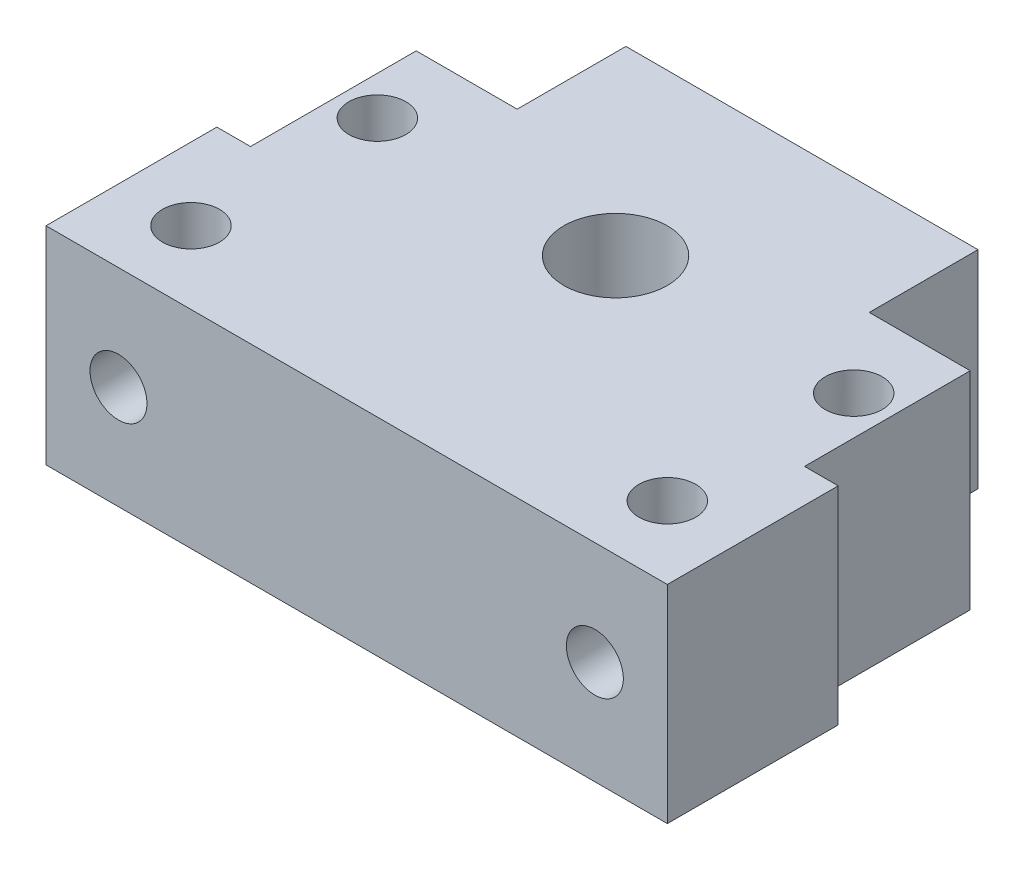
ISO-10303-21;
HEADER;
FILE_DESCRIPTION(('STEP AP214'),'2;1');
FILE_NAME('part.step','',(''),(''),'','','');
FILE_SCHEMA(('AUTOMOTIVE_DESIGN { 1 0 10303 214 1 1 1 1 }'));
ENDSEC;
DATA;
#1=APPLICATION_CONTEXT('core data for automotive mechanical design processes');
#2=APPLICATION_PROTOCOL_DEFINITION('international standard','automotive_design',2000,#1);
#3=PRODUCT_CONTEXT('',#1,'mechanical');
#4=PRODUCT('Part','Part','',(#3));
#5=PRODUCT_RELATED_PRODUCT_CATEGORY('part','',(#4));
#6=PRODUCT_DEFINITION_FORMATION('','',#4);
#7=PRODUCT_DEFINITION_CONTEXT('part definition',#1,'design');
#8=PRODUCT_DEFINITION('design','',#6,#7);
#9=PRODUCT_DEFINITION_SHAPE('','',#8);
#10=(LENGTH_UNIT() NAMED_UNIT(*) SI_UNIT(.MILLI.,.METRE.));
#11=(NAMED_UNIT(*) PLANE_ANGLE_UNIT() SI_UNIT($,.RADIAN.));
#12=(NAMED_UNIT(*) SI_UNIT($,.STERADIAN.) SOLID_ANGLE_UNIT());
#13=UNCERTAINTY_MEASURE_WITH_UNIT(LENGTH_MEASURE(1.E-05),#10,'distance_accuracy_value','');
#14=(GEOMETRIC_REPRESENTATION_CONTEXT(3) GLOBAL_UNCERTAINTY_ASSIGNED_CONTEXT((#13)) GLOBAL_UNIT_ASSIGNED_CONTEXT((#10,
#11,#12)) REPRESENTATION_CONTEXT('',''));
#15=CARTESIAN_POINT('',(0.,0.,0.));
#16=DIRECTION('',(0.,0.,1.));
#17=DIRECTION('',(1.,0.,0.));
#18=AXIS2_PLACEMENT_3D('',#15,#16,#17);
#19=CARTESIAN_POINT('',(-23.,20.,-3.49999999999999));
#20=DIRECTION('',(0.,-1.,0.));
#21=DIRECTION('',(0.,0.,-1.));
#22=AXIS2_PLACEMENT_3D('',#19,#20,#21);
#23=CYLINDRICAL_SURFACE('',#22,2.75);
#24=CARTESIAN_POINT('',(-23.,10.,-3.49999999999999));
#25=DIRECTION('',(0.,-0.707106781186547,-0.707106781186547));
#26=DIRECTION('',(0.,-0.707106781186547,0.707106781186547));
#27=AXIS2_PLACEMENT_3D('',#24,#25,#26);
#28=ELLIPSE('',#27,3.88908729652601,2.75);
#29=CARTESIAN_POINT('',(-20.25,10.,-3.49999999999999));
#30=VERTEX_POINT('',#29);
#31=CARTESIAN_POINT('',(-25.75,10.,-3.49999999999999));
#32=VERTEX_POINT('',#31);
#33=EDGE_CURVE('E196',#30,#32,#28,.F.);
#34=ORIENTED_EDGE('',*,*,#33,.F.);
#35=CARTESIAN_POINT('',(-23.,10.,-3.49999999999999));
#36=DIRECTION('',(0.,-0.707106781186547,0.707106781186547));
#37=DIRECTION('',(0.,-0.707106781186547,-0.707106781186547));
#38=AXIS2_PLACEMENT_3D('',#35,#36,#37);
#39=ELLIPSE('',#38,3.88908729652601,2.75);
#40=EDGE_CURVE('E186',#32,#30,#39,.F.);
#41=ORIENTED_EDGE('',*,*,#40,.F.);
#42=EDGE_LOOP('',(#34,#41));
#43=FACE_BOUND('',#42,.T.);
#44=CARTESIAN_POINT('',(-23.,20.,-3.49999999999999));
#45=DIRECTION('',(0.,1.,0.));
#46=DIRECTION('',(0.,0.,1.));
#47=AXIS2_PLACEMENT_3D('',#44,#45,#46);
#48=CIRCLE('',#47,2.75);
#49=CARTESIAN_POINT('',(-23.,20.,-0.749999999999995));
#50=VERTEX_POINT('',#49);
#51=EDGE_CURVE('E235',#50,#50,#48,.T.);
#52=ORIENTED_EDGE('',*,*,#51,.T.);
#53=EDGE_LOOP('',(#52));
#54=FACE_BOUND('',#53,.T.);
#55=ADVANCED_FACE('F35',(#43,#54),#23,.F.);
#56=CARTESIAN_POINT('',(-23.,20.,14.5));
#57=DIRECTION('',(0.,-1.,0.));
#58=DIRECTION('',(0.,0.,-1.));
#59=AXIS2_PLACEMENT_3D('',#56,#57,#58);
#60=CYLINDRICAL_SURFACE('',#59,2.75);
#61=CARTESIAN_POINT('',(-23.,10.,14.5));
#62=DIRECTION('',(0.,-0.707106781186547,-0.707106781186547));
#63=DIRECTION('',(0.,-0.707106781186547,0.707106781186547));
#64=AXIS2_PLACEMENT_3D('',#61,#62,#63);
#65=ELLIPSE('',#64,3.88908729652601,2.75);
#66=CARTESIAN_POINT('',(-20.25,10.,14.5));
#67=VERTEX_POINT('',#66);
#68=CARTESIAN_POINT('',(-25.75,10.,14.5));
#69=VERTEX_POINT('',#68);
#70=EDGE_CURVE('E319',#67,#69,#65,.F.);
#71=ORIENTED_EDGE('',*,*,#70,.F.);
#72=CARTESIAN_POINT('',(-23.,10.,14.5));
#73=DIRECTION('',(0.,-0.707106781186547,0.707106781186547));
#74=DIRECTION('',(0.,-0.707106781186547,-0.707106781186547));
#75=AXIS2_PLACEMENT_3D('',#72,#73,#74);
#76=ELLIPSE('',#75,3.88908729652601,2.75);
#77=EDGE_CURVE('E311',#69,#67,#76,.F.);
#78=ORIENTED_EDGE('',*,*,#77,.F.);
#79=EDGE_LOOP('',(#71,#78));
#80=FACE_BOUND('',#79,.T.);
#81=CARTESIAN_POINT('',(-23.,20.,14.5));
#82=DIRECTION('',(0.,1.,0.));
#83=DIRECTION('',(0.,0.,1.));
#84=AXIS2_PLACEMENT_3D('',#81,#82,#83);
#85=CIRCLE('',#84,2.75);
#86=CARTESIAN_POINT('',(-23.,20.,17.25));
#87=VERTEX_POINT('',#86);
#88=EDGE_CURVE('E229',#87,#87,#85,.T.);
#89=ORIENTED_EDGE('',*,*,#88,.T.);
#90=EDGE_LOOP('',(#89));
#91=FACE_BOUND('',#90,.T.);
#92=ADVANCED_FACE('F379',(#80,#91),#60,.F.);
#93=CARTESIAN_POINT('',(23.,20.,-3.5));
#94=DIRECTION('',(0.,-1.,0.));
#95=DIRECTION('',(0.,0.,-1.));
#96=AXIS2_PLACEMENT_3D('',#93,#94,#95);
#97=CYLINDRICAL_SURFACE('',#96,2.75);
#98=CARTESIAN_POINT('',(23.,10.,-3.5));
#99=DIRECTION('',(0.,-0.707106781186547,-0.707106781186547));
#100=DIRECTION('',(0.,-0.707106781186547,0.707106781186547));
#101=AXIS2_PLACEMENT_3D('',#98,#99,#100);
#102=ELLIPSE('',#101,3.88908729652601,2.75);
#103=CARTESIAN_POINT('',(25.75,10.,-3.5));
#104=VERTEX_POINT('',#103);
#105=CARTESIAN_POINT('',(20.25,10.,-3.5));
#106=VERTEX_POINT('',#105);
#107=EDGE_CURVE('E213',#104,#106,#102,.F.);
#108=ORIENTED_EDGE('',*,*,#107,.F.);
#109=CARTESIAN_POINT('',(23.,10.,-3.5));
#110=DIRECTION('',(0.,-0.707106781186547,0.707106781186547));
#111=DIRECTION('',(0.,-0.707106781186547,-0.707106781186547));
#112=AXIS2_PLACEMENT_3D('',#109,#110,#111);
#113=ELLIPSE('',#112,3.88908729652601,2.75);
#114=EDGE_CURVE('E203',#106,#104,#113,.F.);
#115=ORIENTED_EDGE('',*,*,#114,.F.);
#116=EDGE_LOOP('',(#108,#115));
#117=FACE_BOUND('',#116,.T.);
#118=CARTESIAN_POINT('',(23.,20.,-3.5));
#119=DIRECTION('',(0.,1.,0.));
#120=DIRECTION('',(0.,0.,1.));
#121=AXIS2_PLACEMENT_3D('',#118,#119,#120);
#122=CIRCLE('',#121,2.75);
#123=CARTESIAN_POINT('',(23.,20.,-0.750000000000002));
#124=VERTEX_POINT('',#123);
#125=EDGE_CURVE('E223',#124,#124,#122,.T.);
#126=ORIENTED_EDGE('',*,*,#125,.T.);
#127=EDGE_LOOP('',(#126));
#128=FACE_BOUND('',#127,.T.);
#129=ADVANCED_FACE('F386',(#117,#128),#97,.F.);
#130=CARTESIAN_POINT('',(23.,20.,14.5));
#131=DIRECTION('',(0.,-1.,0.));
#132=DIRECTION('',(0.,0.,-1.));
#133=AXIS2_PLACEMENT_3D('',#130,#131,#132);
#134=CYLINDRICAL_SURFACE('',#133,2.75);
#135=CARTESIAN_POINT('',(23.,10.,14.5));
#136=DIRECTION('',(0.,-0.707106781186547,-0.707106781186547));
#137=DIRECTION('',(0.,-0.707106781186547,0.707106781186547));
#138=AXIS2_PLACEMENT_3D('',#135,#136,#137);
#139=ELLIPSE('',#138,3.88908729652601,2.75);
#140=CARTESIAN_POINT('',(25.75,10.,14.5));
#141=VERTEX_POINT('',#140);
#142=CARTESIAN_POINT('',(20.25,10.,14.5));
#143=VERTEX_POINT('',#142);
#144=EDGE_CURVE('E308',#141,#143,#139,.F.);
#145=ORIENTED_EDGE('',*,*,#144,.F.);
#146=CARTESIAN_POINT('',(23.,10.,14.5));
#147=DIRECTION('',(0.,-0.707106781186547,0.707106781186547));
#148=DIRECTION('',(0.,-0.707106781186547,-0.707106781186547));
#149=AXIS2_PLACEMENT_3D('',#146,#147,#148);
#150=ELLIPSE('',#149,3.88908729652601,2.75);
#151=EDGE_CURVE('E300',#143,#141,#150,.F.);
#152=ORIENTED_EDGE('',*,*,#151,.F.);
#153=EDGE_LOOP('',(#145,#152));
#154=FACE_BOUND('',#153,.T.);
#155=CARTESIAN_POINT('',(23.,20.,14.5));
#156=DIRECTION('',(0.,1.,0.));
#157=DIRECTION('',(0.,0.,1.));
#158=AXIS2_PLACEMENT_3D('',#155,#156,#157);
#159=CIRCLE('',#158,2.75);
#160=CARTESIAN_POINT('',(23.,20.,17.25));
#161=VERTEX_POINT('',#160);
#162=EDGE_CURVE('E217',#161,#161,#159,.T.);
#163=ORIENTED_EDGE('',*,*,#162,.T.);
#164=EDGE_LOOP('',(#163));
#165=FACE_BOUND('',#164,.T.);
#166=ADVANCED_FACE('F421',(#154,#165),#134,.F.);
#167=CARTESIAN_POINT('',(0.,20.,0.));
#168=DIRECTION('',(0.,-1.,0.));
#169=DIRECTION('',(0.,0.,-1.));
#170=AXIS2_PLACEMENT_3D('',#167,#168,#169);
#171=PLANE('',#170);
#172=ORIENTED_EDGE('',*,*,#125,.F.);
#173=EDGE_LOOP('',(#172));
#174=FACE_BOUND('',#173,.T.);
#175=ORIENTED_EDGE('',*,*,#51,.F.);
#176=EDGE_LOOP('',(#175));
#177=FACE_BOUND('',#176,.T.);
#178=DIRECTION('',(0.,0.,1.));
#179=VECTOR('',#178,1.);
#180=CARTESIAN_POINT('',(-26.75,20.,-27.));
#181=LINE('',#180,#179);
#182=CARTESIAN_POINT('',(-26.75,20.,-11.));
#183=VERTEX_POINT('',#182);
#184=CARTESIAN_POINT('',(-26.75,20.,4.99999999999999));
#185=VERTEX_POINT('',#184);
#186=EDGE_CURVE('E152',#183,#185,#181,.T.);
#187=ORIENTED_EDGE('',*,*,#186,.T.);
#188=DIRECTION('',(-1.,0.,0.));
#189=VECTOR('',#188,1.);
#190=CARTESIAN_POINT('',(-33.25,20.,4.99999999999999));
#191=LINE('',#190,#189);
#192=CARTESIAN_POINT('',(-30.,20.,4.99999999999999));
#193=VERTEX_POINT('',#192);
#194=EDGE_CURVE('E155',#185,#193,#191,.T.);
#195=ORIENTED_EDGE('',*,*,#194,.T.);
#196=DIRECTION('',(0.,0.,1.));
#197=VECTOR('',#196,1.);
#198=CARTESIAN_POINT('',(-30.,20.,21.5));
#199=LINE('',#198,#197);
#200=CARTESIAN_POINT('',(-30.,20.,21.5));
#201=VERTEX_POINT('',#200);
#202=EDGE_CURVE('E256',#193,#201,#199,.T.);
#203=ORIENTED_EDGE('',*,*,#202,.T.);
#204=DIRECTION('',(1.,0.,0.));
#205=VECTOR('',#204,1.);
#206=CARTESIAN_POINT('',(30.,20.,21.5));
#207=LINE('',#206,#205);
#208=CARTESIAN_POINT('',(30.,20.,21.5));
#209=VERTEX_POINT('',#208);
#210=EDGE_CURVE('E258',#201,#209,#207,.T.);
#211=ORIENTED_EDGE('',*,*,#210,.T.);
#212=DIRECTION('',(0.,0.,-1.));
#213=VECTOR('',#212,1.);
#214=CARTESIAN_POINT('',(30.,20.,21.5));
#215=LINE('',#214,#213);
#216=CARTESIAN_POINT('',(30.,20.,4.99999999999999));
#217=VERTEX_POINT('',#216);
#218=EDGE_CURVE('E260',#209,#217,#215,.T.);
#219=ORIENTED_EDGE('',*,*,#218,.T.);
#220=DIRECTION('',(-1.,0.,0.));
#221=VECTOR('',#220,1.);
#222=CARTESIAN_POINT('',(33.25,20.,4.99999999999999));
#223=LINE('',#222,#221);
#224=CARTESIAN_POINT('',(26.75,20.,4.99999999999999));
#225=VERTEX_POINT('',#224);
#226=EDGE_CURVE('E174',#217,#225,#223,.T.);
#227=ORIENTED_EDGE('',*,*,#226,.T.);
#228=DIRECTION('',(0.,0.,-1.));
#229=VECTOR('',#228,1.);
#230=CARTESIAN_POINT('',(26.75,20.,-27.));
#231=LINE('',#230,#229);
#232=CARTESIAN_POINT('',(26.75,20.,-11.));
#233=VERTEX_POINT('',#232);
#234=EDGE_CURVE('E171',#225,#233,#231,.T.);
#235=ORIENTED_EDGE('',*,*,#234,.T.);
#236=DIRECTION('',(-1.,0.,0.));
#237=VECTOR('',#236,1.);
#238=CARTESIAN_POINT('',(30.,20.,-11.));
#239=LINE('',#238,#237);
#240=CARTESIAN_POINT('',(17.,20.,-11.));
#241=VERTEX_POINT('',#240);
#242=EDGE_CURVE('E263',#233,#241,#239,.T.);
#243=ORIENTED_EDGE('',*,*,#242,.T.);
#244=DIRECTION('',(0.,0.,-1.));
#245=VECTOR('',#244,1.);
#246=CARTESIAN_POINT('',(17.,20.,-21.5));
#247=LINE('',#246,#245);
#248=CARTESIAN_POINT('',(17.,20.,-21.5));
#249=VERTEX_POINT('',#248);
#250=EDGE_CURVE('E247',#241,#249,#247,.T.);
#251=ORIENTED_EDGE('',*,*,#250,.T.);
#252=DIRECTION('',(-1.,0.,0.));
#253=VECTOR('',#252,1.);
#254=CARTESIAN_POINT('',(17.,20.,-21.5));
#255=LINE('',#254,#253);
#256=CARTESIAN_POINT('',(-17.,20.,-21.5));
#257=VERTEX_POINT('',#256);
#258=EDGE_CURVE('E250',#249,#257,#255,.T.);
#259=ORIENTED_EDGE('',*,*,#258,.T.);
#260=DIRECTION('',(0.,0.,1.));
#261=VECTOR('',#260,1.);
#262=CARTESIAN_POINT('',(-17.,20.,-21.5));
#263=LINE('',#262,#261);
#264=CARTESIAN_POINT('',(-17.,20.,-11.));
#265=VERTEX_POINT('',#264);
#266=EDGE_CURVE('E253',#257,#265,#263,.T.);
#267=ORIENTED_EDGE('',*,*,#266,.T.);
#268=DIRECTION('',(-1.,0.,0.));
#269=VECTOR('',#268,1.);
#270=CARTESIAN_POINT('',(-30.,20.,-11.));
#271=LINE('',#270,#269);
#272=EDGE_CURVE('E166',#265,#183,#271,.T.);
#273=ORIENTED_EDGE('',*,*,#272,.T.);
#274=EDGE_LOOP('',(#187,#195,#203,#211,#219,#227,#235,#243,#251,#259,#267,#273));
#275=FACE_BOUND('',#274,.T.);
#276=CARTESIAN_POINT('',(0.,20.,-3.5));
#277=DIRECTION('',(0.,1.,0.));
#278=DIRECTION('',(0.,0.,1.));
#279=AXIS2_PLACEMENT_3D('',#276,#277,#278);
#280=CIRCLE('',#279,5.);
#281=CARTESIAN_POINT('',(0.,20.,1.5));
#282=VERTEX_POINT('',#281);
#283=EDGE_CURVE('E241',#282,#282,#280,.T.);
#284=ORIENTED_EDGE('',*,*,#283,.F.);
#285=EDGE_LOOP('',(#284));
#286=FACE_BOUND('',#285,.T.);
#287=ORIENTED_EDGE('',*,*,#88,.F.);
#288=EDGE_LOOP('',(#287));
#289=FACE_BOUND('',#288,.T.);
#290=ORIENTED_EDGE('',*,*,#162,.F.);
#291=EDGE_LOOP('',(#290));
#292=FACE_BOUND('',#291,.T.);
#293=ADVANCED_FACE('F163',(#174,#177,#275,#286,#289,#292),#171,.F.);
#294=CARTESIAN_POINT('',(0.,0.,0.));
#295=DIRECTION('',(0.,-1.,0.));
#296=DIRECTION('',(0.,0.,-1.));
#297=AXIS2_PLACEMENT_3D('',#294,#295,#296);
#298=PLANE('',#297);
#299=DIRECTION('',(-1.,0.,0.));
#300=VECTOR('',#299,1.);
#301=CARTESIAN_POINT('',(-33.25,0.,4.99999999999999));
#302=LINE('',#301,#300);
#303=CARTESIAN_POINT('',(-26.75,0.,4.99999999999999));
#304=VERTEX_POINT('',#303);
#305=CARTESIAN_POINT('',(-30.,0.,4.99999999999999));
#306=VERTEX_POINT('',#305);
#307=EDGE_CURVE('E50',#304,#306,#302,.T.);
#308=ORIENTED_EDGE('',*,*,#307,.F.);
#309=DIRECTION('',(0.,0.,1.));
#310=VECTOR('',#309,1.);
#311=CARTESIAN_POINT('',(-26.75,0.,-27.));
#312=LINE('',#311,#310);
#313=CARTESIAN_POINT('',(-26.75,0.,-11.));
#314=VERTEX_POINT('',#313);
#315=EDGE_CURVE('E154',#314,#304,#312,.T.);
#316=ORIENTED_EDGE('',*,*,#315,.F.);
#317=DIRECTION('',(-1.,0.,0.));
#318=VECTOR('',#317,1.);
#319=CARTESIAN_POINT('',(-30.,0.,-11.));
#320=LINE('',#319,#318);
#321=CARTESIAN_POINT('',(-17.,0.,-11.));
#322=VERTEX_POINT('',#321);
#323=EDGE_CURVE('E272',#322,#314,#320,.T.);
#324=ORIENTED_EDGE('',*,*,#323,.F.);
#325=DIRECTION('',(0.,0.,1.));
#326=VECTOR('',#325,1.);
#327=CARTESIAN_POINT('',(-17.,0.,-21.5));
#328=LINE('',#327,#326);
#329=CARTESIAN_POINT('',(-17.,0.,-21.5));
#330=VERTEX_POINT('',#329);
#331=EDGE_CURVE('E270',#330,#322,#328,.T.);
#332=ORIENTED_EDGE('',*,*,#331,.F.);
#333=DIRECTION('',(-1.,0.,0.));
#334=VECTOR('',#333,1.);
#335=CARTESIAN_POINT('',(17.,0.,-21.5));
#336=LINE('',#335,#334);
#337=CARTESIAN_POINT('',(17.,0.,-21.5));
#338=VERTEX_POINT('',#337);
#339=EDGE_CURVE('E268',#338,#330,#336,.T.);
#340=ORIENTED_EDGE('',*,*,#339,.F.);
#341=DIRECTION('',(0.,0.,-1.));
#342=VECTOR('',#341,1.);
#343=CARTESIAN_POINT('',(17.,0.,-21.5));
#344=LINE('',#343,#342);
#345=CARTESIAN_POINT('',(17.,0.,-11.));
#346=VERTEX_POINT('',#345);
#347=EDGE_CURVE('E244',#346,#338,#344,.T.);
#348=ORIENTED_EDGE('',*,*,#347,.F.);
#349=DIRECTION('',(-1.,0.,0.));
#350=VECTOR('',#349,1.);
#351=CARTESIAN_POINT('',(30.,0.,-11.));
#352=LINE('',#351,#350);
#353=CARTESIAN_POINT('',(26.75,0.,-11.));
#354=VERTEX_POINT('',#353);
#355=EDGE_CURVE('E251',#354,#346,#352,.T.);
#356=ORIENTED_EDGE('',*,*,#355,.F.);
#357=DIRECTION('',(0.,0.,-1.));
#358=VECTOR('',#357,1.);
#359=CARTESIAN_POINT('',(26.75,0.,-27.));
#360=LINE('',#359,#358);
#361=CARTESIAN_POINT('',(26.75,0.,4.99999999999999));
#362=VERTEX_POINT('',#361);
#363=EDGE_CURVE('E58',#362,#354,#360,.T.);
#364=ORIENTED_EDGE('',*,*,#363,.F.);
#365=DIRECTION('',(-1.,0.,0.));
#366=VECTOR('',#365,1.);
#367=CARTESIAN_POINT('',(33.25,0.,4.99999999999999));
#368=LINE('',#367,#366);
#369=CARTESIAN_POINT('',(30.,0.,4.99999999999999));
#370=VERTEX_POINT('',#369);
#371=EDGE_CURVE('E175',#370,#362,#368,.T.);
#372=ORIENTED_EDGE('',*,*,#371,.F.);
#373=DIRECTION('',(0.,0.,-1.));
#374=VECTOR('',#373,1.);
#375=CARTESIAN_POINT('',(30.,0.,21.5));
#376=LINE('',#375,#374);
#377=CARTESIAN_POINT('',(30.,0.,21.5));
#378=VERTEX_POINT('',#377);
#379=EDGE_CURVE('E279',#378,#370,#376,.T.);
#380=ORIENTED_EDGE('',*,*,#379,.F.);
#381=DIRECTION('',(1.,0.,0.));
#382=VECTOR('',#381,1.);
#383=CARTESIAN_POINT('',(30.,0.,21.5));
#384=LINE('',#383,#382);
#385=CARTESIAN_POINT('',(-30.,0.,21.5));
#386=VERTEX_POINT('',#385);
#387=EDGE_CURVE('E277',#386,#378,#384,.T.);
#388=ORIENTED_EDGE('',*,*,#387,.F.);
#389=DIRECTION('',(0.,0.,1.));
#390=VECTOR('',#389,1.);
#391=CARTESIAN_POINT('',(-30.,0.,21.5));
#392=LINE('',#391,#390);
#393=EDGE_CURVE('E275',#306,#386,#392,.T.);
#394=ORIENTED_EDGE('',*,*,#393,.F.);
#395=EDGE_LOOP('',(#308,#316,#324,#332,#340,#348,#356,#364,#372,#380,#388,#394));
#396=FACE_BOUND('',#395,.T.);
#397=CARTESIAN_POINT('',(23.,0.,-3.5));
#398=DIRECTION('',(0.,1.,0.));
#399=DIRECTION('',(0.,0.,1.));
#400=AXIS2_PLACEMENT_3D('',#397,#398,#399);
#401=CIRCLE('',#400,2.75);
#402=CARTESIAN_POINT('',(23.,0.,-0.750000000000002));
#403=VERTEX_POINT('',#402);
#404=EDGE_CURVE('E220',#403,#403,#401,.T.);
#405=ORIENTED_EDGE('',*,*,#404,.T.);
#406=EDGE_LOOP('',(#405));
#407=FACE_BOUND('',#406,.T.);
#408=CARTESIAN_POINT('',(-23.,0.,-3.49999999999999));
#409=DIRECTION('',(0.,1.,0.));
#410=DIRECTION('',(0.,0.,1.));
#411=AXIS2_PLACEMENT_3D('',#408,#409,#410);
#412=CIRCLE('',#411,2.75);
#413=CARTESIAN_POINT('',(-23.,0.,-0.749999999999995));
#414=VERTEX_POINT('',#413);
#415=EDGE_CURVE('E232',#414,#414,#412,.T.);
#416=ORIENTED_EDGE('',*,*,#415,.T.);
#417=EDGE_LOOP('',(#416));
#418=FACE_BOUND('',#417,.T.);
#419=CARTESIAN_POINT('',(0.,0.,-3.5));
#420=DIRECTION('',(0.,1.,0.));
#421=DIRECTION('',(0.,0.,1.));
#422=AXIS2_PLACEMENT_3D('',#419,#420,#421);
#423=CIRCLE('',#422,5.);
#424=CARTESIAN_POINT('',(0.,0.,1.5));
#425=VERTEX_POINT('',#424);
#426=EDGE_CURVE('E238',#425,#425,#423,.T.);
#427=ORIENTED_EDGE('',*,*,#426,.T.);
#428=EDGE_LOOP('',(#427));
#429=FACE_BOUND('',#428,.T.);
#430=CARTESIAN_POINT('',(-23.,0.,14.5));
#431=DIRECTION('',(0.,1.,0.));
#432=DIRECTION('',(0.,0.,1.));
#433=AXIS2_PLACEMENT_3D('',#430,#431,#432);
#434=CIRCLE('',#433,2.75);
#435=CARTESIAN_POINT('',(-23.,0.,17.25));
#436=VERTEX_POINT('',#435);
#437=EDGE_CURVE('E226',#436,#436,#434,.T.);
#438=ORIENTED_EDGE('',*,*,#437,.T.);
#439=EDGE_LOOP('',(#438));
#440=FACE_BOUND('',#439,.T.);
#441=CARTESIAN_POINT('',(23.,0.,14.5));
#442=DIRECTION('',(0.,1.,0.));
#443=DIRECTION('',(0.,0.,1.));
#444=AXIS2_PLACEMENT_3D('',#441,#442,#443);
#445=CIRCLE('',#444,2.75);
#446=CARTESIAN_POINT('',(23.,0.,17.25));
#447=VERTEX_POINT('',#446);
#448=EDGE_CURVE('E216',#447,#447,#445,.T.);
#449=ORIENTED_EDGE('',*,*,#448,.T.);
#450=EDGE_LOOP('',(#449));
#451=FACE_BOUND('',#450,.T.);
#452=ADVANCED_FACE('F332',(#396,#407,#418,#429,#440,#451),#298,.T.);
#453=CARTESIAN_POINT('',(17.,20.,-21.5));
#454=DIRECTION('',(-1.,0.,0.));
#455=DIRECTION('',(0.,0.,1.));
#456=AXIS2_PLACEMENT_3D('',#453,#454,#455);
#457=PLANE('',#456);
#458=ORIENTED_EDGE('',*,*,#347,.T.);
#459=DIRECTION('',(0.,-1.,0.));
#460=VECTOR('',#459,1.);
#461=CARTESIAN_POINT('',(17.,20.,-21.5));
#462=LINE('',#461,#460);
#463=EDGE_CURVE('E297',#249,#338,#462,.T.);
#464=ORIENTED_EDGE('',*,*,#463,.F.);
#465=ORIENTED_EDGE('',*,*,#250,.F.);
#466=DIRECTION('',(0.,-1.,0.));
#467=VECTOR('',#466,1.);
#468=CARTESIAN_POINT('',(17.,20.,-11.));
#469=LINE('',#468,#467);
#470=EDGE_CURVE('E265',#241,#346,#469,.T.);
#471=ORIENTED_EDGE('',*,*,#470,.T.);
#472=EDGE_LOOP('',(#458,#464,#465,#471));
#473=FACE_BOUND('',#472,.T.);
#474=ADVANCED_FACE('F37',(#473),#457,.F.);
#475=CARTESIAN_POINT('',(17.,20.,-21.5));
#476=DIRECTION('',(0.,0.,1.));
#477=DIRECTION('',(1.,0.,0.));
#478=AXIS2_PLACEMENT_3D('',#475,#476,#477);
#479=PLANE('',#478);
#480=ORIENTED_EDGE('',*,*,#339,.T.);
#481=DIRECTION('',(0.,-1.,0.));
#482=VECTOR('',#481,1.);
#483=CARTESIAN_POINT('',(-17.,20.,-21.5));
#484=LINE('',#483,#482);
#485=EDGE_CURVE('E294',#257,#330,#484,.T.);
#486=ORIENTED_EDGE('',*,*,#485,.F.);
#487=ORIENTED_EDGE('',*,*,#258,.F.);
#488=ORIENTED_EDGE('',*,*,#463,.T.);
#489=EDGE_LOOP('',(#480,#486,#487,#488));
#490=FACE_BOUND('',#489,.T.);
#491=ADVANCED_FACE('F361',(#490),#479,.F.);
#492=CARTESIAN_POINT('',(-17.,20.,-21.5));
#493=DIRECTION('',(1.,0.,0.));
#494=DIRECTION('',(0.,0.,-1.));
#495=AXIS2_PLACEMENT_3D('',#492,#493,#494);
#496=PLANE('',#495);
#497=ORIENTED_EDGE('',*,*,#331,.T.);
#498=DIRECTION('',(0.,-1.,0.));
#499=VECTOR('',#498,1.);
#500=CARTESIAN_POINT('',(-17.,20.,-11.));
#501=LINE('',#500,#499);
#502=EDGE_CURVE('E291',#265,#322,#501,.T.);
#503=ORIENTED_EDGE('',*,*,#502,.F.);
#504=ORIENTED_EDGE('',*,*,#266,.F.);
#505=ORIENTED_EDGE('',*,*,#485,.T.);
#506=EDGE_LOOP('',(#497,#503,#504,#505));
#507=FACE_BOUND('',#506,.T.);
#508=ADVANCED_FACE('F363',(#507),#496,.F.);
#509=CARTESIAN_POINT('',(-30.,20.,-11.));
#510=DIRECTION('',(0.,0.,1.));
#511=DIRECTION('',(1.,0.,0.));
#512=AXIS2_PLACEMENT_3D('',#509,#510,#511);
#513=PLANE('',#512);
#514=CARTESIAN_POINT('',(-23.,10.,-11.));
#515=DIRECTION('',(0.,0.,-1.));
#516=DIRECTION('',(-1.,0.,0.));
#517=AXIS2_PLACEMENT_3D('',#514,#515,#516);
#518=CIRCLE('',#517,2.75);
#519=CARTESIAN_POINT('',(-25.75,10.,-11.));
#520=VERTEX_POINT('',#519);
#521=EDGE_CURVE('E182',#520,#520,#518,.T.);
#522=ORIENTED_EDGE('',*,*,#521,.F.);
#523=EDGE_LOOP('',(#522));
#524=FACE_BOUND('',#523,.T.);
#525=ORIENTED_EDGE('',*,*,#323,.T.);
#526=DIRECTION('',(0.,1.,0.));
#527=VECTOR('',#526,1.);
#528=CARTESIAN_POINT('',(-26.75,20.,-11.));
#529=LINE('',#528,#527);
#530=EDGE_CURVE('E11',#314,#183,#529,.T.);
#531=ORIENTED_EDGE('',*,*,#530,.T.);
#532=ORIENTED_EDGE('',*,*,#272,.F.);
#533=ORIENTED_EDGE('',*,*,#502,.T.);
#534=EDGE_LOOP('',(#525,#531,#532,#533));
#535=FACE_BOUND('',#534,.T.);
#536=ADVANCED_FACE('F366',(#524,#535),#513,.F.);
#537=CARTESIAN_POINT('',(-30.,20.,21.5));
#538=DIRECTION('',(1.,0.,0.));
#539=DIRECTION('',(0.,0.,-1.));
#540=AXIS2_PLACEMENT_3D('',#537,#538,#539);
#541=PLANE('',#540);
#542=ORIENTED_EDGE('',*,*,#202,.F.);
#543=DIRECTION('',(0.,-1.,0.));
#544=VECTOR('',#543,1.);
#545=CARTESIAN_POINT('',(-30.,20.,4.99999999999999));
#546=LINE('',#545,#544);
#547=EDGE_CURVE('E43',#193,#306,#546,.T.);
#548=ORIENTED_EDGE('',*,*,#547,.T.);
#549=ORIENTED_EDGE('',*,*,#393,.T.);
#550=DIRECTION('',(0.,-1.,0.));
#551=VECTOR('',#550,1.);
#552=CARTESIAN_POINT('',(-30.,20.,21.5));
#553=LINE('',#552,#551);
#554=EDGE_CURVE('E288',#201,#386,#553,.T.);
#555=ORIENTED_EDGE('',*,*,#554,.F.);
#556=EDGE_LOOP('',(#542,#548,#549,#555));
#557=FACE_BOUND('',#556,.T.);
#558=ADVANCED_FACE('F328',(#557),#541,.F.);
#559=CARTESIAN_POINT('',(30.,20.,21.5));
#560=DIRECTION('',(0.,0.,-1.));
#561=DIRECTION('',(-1.,0.,0.));
#562=AXIS2_PLACEMENT_3D('',#559,#560,#561);
#563=PLANE('',#562);
#564=CARTESIAN_POINT('',(-23.,10.,21.5));
#565=DIRECTION('',(0.,0.,-1.));
#566=DIRECTION('',(-1.,0.,0.));
#567=AXIS2_PLACEMENT_3D('',#564,#565,#566);
#568=CIRCLE('',#567,2.75);
#569=CARTESIAN_POINT('',(-25.75,10.,21.5));
#570=VERTEX_POINT('',#569);
#571=EDGE_CURVE('E183',#570,#570,#568,.T.);
#572=ORIENTED_EDGE('',*,*,#571,.T.);
#573=EDGE_LOOP('',(#572));
#574=FACE_BOUND('',#573,.T.);
#575=CARTESIAN_POINT('',(23.,10.,21.5));
#576=DIRECTION('',(0.,0.,-1.));
#577=DIRECTION('',(-1.,0.,0.));
#578=AXIS2_PLACEMENT_3D('',#575,#576,#577);
#579=CIRCLE('',#578,2.75);
#580=CARTESIAN_POINT('',(20.25,10.,21.5));
#581=VERTEX_POINT('',#580);
#582=EDGE_CURVE('E200',#581,#581,#579,.T.);
#583=ORIENTED_EDGE('',*,*,#582,.T.);
#584=EDGE_LOOP('',(#583));
#585=FACE_BOUND('',#584,.T.);
#586=ORIENTED_EDGE('',*,*,#387,.T.);
#587=DIRECTION('',(0.,-1.,0.));
#588=VECTOR('',#587,1.);
#589=CARTESIAN_POINT('',(30.,20.,21.5));
#590=LINE('',#589,#588);
#591=EDGE_CURVE('E285',#209,#378,#590,.T.);
#592=ORIENTED_EDGE('',*,*,#591,.F.);
#593=ORIENTED_EDGE('',*,*,#210,.F.);
#594=ORIENTED_EDGE('',*,*,#554,.T.);
#595=EDGE_LOOP('',(#586,#592,#593,#594));
#596=FACE_BOUND('',#595,.T.);
#597=ADVANCED_FACE('F338',(#574,#585,#596),#563,.F.);
#598=CARTESIAN_POINT('',(30.,20.,21.5));
#599=DIRECTION('',(-1.,0.,0.));
#600=DIRECTION('',(0.,0.,1.));
#601=AXIS2_PLACEMENT_3D('',#598,#599,#600);
#602=PLANE('',#601);
#603=ORIENTED_EDGE('',*,*,#379,.T.);
#604=DIRECTION('',(0.,1.,0.));
#605=VECTOR('',#604,1.);
#606=CARTESIAN_POINT('',(30.,20.,4.99999999999999));
#607=LINE('',#606,#605);
#608=EDGE_CURVE('E324',#370,#217,#607,.T.);
#609=ORIENTED_EDGE('',*,*,#608,.T.);
#610=ORIENTED_EDGE('',*,*,#218,.F.);
#611=ORIENTED_EDGE('',*,*,#591,.T.);
#612=EDGE_LOOP('',(#603,#609,#610,#611));
#613=FACE_BOUND('',#612,.T.);
#614=ADVANCED_FACE('F342',(#613),#602,.F.);
#615=CARTESIAN_POINT('',(30.,20.,-11.));
#616=DIRECTION('',(0.,0.,1.));
#617=DIRECTION('',(1.,0.,0.));
#618=AXIS2_PLACEMENT_3D('',#615,#616,#617);
#619=PLANE('',#618);
#620=CARTESIAN_POINT('',(23.,10.,-11.));
#621=DIRECTION('',(0.,0.,-1.));
#622=DIRECTION('',(-1.,0.,0.));
#623=AXIS2_PLACEMENT_3D('',#620,#621,#622);
#624=CIRCLE('',#623,2.75);
#625=CARTESIAN_POINT('',(20.25,10.,-11.));
#626=VERTEX_POINT('',#625);
#627=EDGE_CURVE('E199',#626,#626,#624,.T.);
#628=ORIENTED_EDGE('',*,*,#627,.F.);
#629=EDGE_LOOP('',(#628));
#630=FACE_BOUND('',#629,.T.);
#631=ORIENTED_EDGE('',*,*,#242,.F.);
#632=DIRECTION('',(0.,-1.,0.));
#633=VECTOR('',#632,1.);
#634=CARTESIAN_POINT('',(26.75,20.,-11.));
#635=LINE('',#634,#633);
#636=EDGE_CURVE('E322',#233,#354,#635,.T.);
#637=ORIENTED_EDGE('',*,*,#636,.T.);
#638=ORIENTED_EDGE('',*,*,#355,.T.);
#639=ORIENTED_EDGE('',*,*,#470,.F.);
#640=EDGE_LOOP('',(#631,#637,#638,#639));
#641=FACE_BOUND('',#640,.T.);
#642=ADVANCED_FACE('F350',(#630,#641),#619,.F.);
#643=CARTESIAN_POINT('',(0.,20.,-3.5));
#644=DIRECTION('',(0.,-1.,0.));
#645=DIRECTION('',(0.,0.,-1.));
#646=AXIS2_PLACEMENT_3D('',#643,#644,#645);
#647=CYLINDRICAL_SURFACE('',#646,5.);
#648=ORIENTED_EDGE('',*,*,#283,.T.);
#649=EDGE_LOOP('',(#648));
#650=FACE_BOUND('',#649,.T.);
#651=ORIENTED_EDGE('',*,*,#426,.F.);
#652=EDGE_LOOP('',(#651));
#653=FACE_BOUND('',#652,.T.);
#654=ADVANCED_FACE('F394',(#650,#653),#647,.F.);
#655=CARTESIAN_POINT('',(-23.,10.,-3.49999999999999));
#656=DIRECTION('',(0.,-0.707106781186547,-0.707106781186547));
#657=DIRECTION('',(0.,-0.707106781186547,0.707106781186547));
#658=AXIS2_PLACEMENT_3D('',#655,#656,#657);
#659=ELLIPSE('',#658,3.88908729652601,2.75);
#660=EDGE_CURVE('E193',#30,#32,#659,.T.);
#661=ORIENTED_EDGE('',*,*,#660,.F.);
#662=CARTESIAN_POINT('',(-23.,10.,-3.49999999999999));
#663=DIRECTION('',(0.,-0.707106781186547,0.707106781186547));
#664=DIRECTION('',(0.,-0.707106781186547,-0.707106781186547));
#665=AXIS2_PLACEMENT_3D('',#662,#663,#664);
#666=ELLIPSE('',#665,3.88908729652601,2.75);
#667=EDGE_CURVE('E191',#32,#30,#666,.T.);
#668=ORIENTED_EDGE('',*,*,#667,.F.);
#669=EDGE_LOOP('',(#661,#668));
#670=FACE_BOUND('',#669,.T.);
#671=ORIENTED_EDGE('',*,*,#415,.F.);
#672=EDGE_LOOP('',(#671));
#673=FACE_BOUND('',#672,.T.);
#674=ADVANCED_FACE('F382',(#670,#673),#23,.F.);
#675=CARTESIAN_POINT('',(-23.,10.,14.5));
#676=DIRECTION('',(0.,-0.707106781186547,-0.707106781186547));
#677=DIRECTION('',(0.,-0.707106781186547,0.707106781186547));
#678=AXIS2_PLACEMENT_3D('',#675,#676,#677);
#679=ELLIPSE('',#678,3.88908729652601,2.75);
#680=EDGE_CURVE('E316',#67,#69,#679,.T.);
#681=ORIENTED_EDGE('',*,*,#680,.F.);
#682=CARTESIAN_POINT('',(-23.,10.,14.5));
#683=DIRECTION('',(0.,-0.707106781186547,0.707106781186547));
#684=DIRECTION('',(0.,-0.707106781186547,-0.707106781186547));
#685=AXIS2_PLACEMENT_3D('',#682,#683,#684);
#686=ELLIPSE('',#685,3.88908729652601,2.75);
#687=EDGE_CURVE('E314',#69,#67,#686,.T.);
#688=ORIENTED_EDGE('',*,*,#687,.F.);
#689=EDGE_LOOP('',(#681,#688));
#690=FACE_BOUND('',#689,.T.);
#691=ORIENTED_EDGE('',*,*,#437,.F.);
#692=EDGE_LOOP('',(#691));
#693=FACE_BOUND('',#692,.T.);
#694=ADVANCED_FACE('F389',(#690,#693),#60,.F.);
#695=CARTESIAN_POINT('',(23.,10.,-3.5));
#696=DIRECTION('',(0.,-0.707106781186547,-0.707106781186547));
#697=DIRECTION('',(0.,-0.707106781186547,0.707106781186547));
#698=AXIS2_PLACEMENT_3D('',#695,#696,#697);
#699=ELLIPSE('',#698,3.88908729652601,2.75);
#700=EDGE_CURVE('E210',#104,#106,#699,.T.);
#701=ORIENTED_EDGE('',*,*,#700,.F.);
#702=CARTESIAN_POINT('',(23.,10.,-3.5));
#703=DIRECTION('',(0.,-0.707106781186547,0.707106781186547));
#704=DIRECTION('',(0.,-0.707106781186547,-0.707106781186547));
#705=AXIS2_PLACEMENT_3D('',#702,#703,#704);
#706=ELLIPSE('',#705,3.88908729652601,2.75);
#707=EDGE_CURVE('E208',#106,#104,#706,.T.);
#708=ORIENTED_EDGE('',*,*,#707,.F.);
#709=EDGE_LOOP('',(#701,#708));
#710=FACE_BOUND('',#709,.T.);
#711=ORIENTED_EDGE('',*,*,#404,.F.);
#712=EDGE_LOOP('',(#711));
#713=FACE_BOUND('',#712,.T.);
#714=ADVANCED_FACE('F400',(#710,#713),#97,.F.);
#715=CARTESIAN_POINT('',(23.,10.,14.5));
#716=DIRECTION('',(0.,-0.707106781186547,-0.707106781186547));
#717=DIRECTION('',(0.,-0.707106781186547,0.707106781186547));
#718=AXIS2_PLACEMENT_3D('',#715,#716,#717);
#719=ELLIPSE('',#718,3.88908729652601,2.75);
#720=EDGE_CURVE('E305',#141,#143,#719,.T.);
#721=ORIENTED_EDGE('',*,*,#720,.F.);
#722=CARTESIAN_POINT('',(23.,10.,14.5));
#723=DIRECTION('',(0.,-0.707106781186547,0.707106781186547));
#724=DIRECTION('',(0.,-0.707106781186547,-0.707106781186547));
#725=AXIS2_PLACEMENT_3D('',#722,#723,#724);
#726=ELLIPSE('',#725,3.88908729652601,2.75);
#727=EDGE_CURVE('E303',#143,#141,#726,.T.);
#728=ORIENTED_EDGE('',*,*,#727,.F.);
#729=EDGE_LOOP('',(#721,#728));
#730=FACE_BOUND('',#729,.T.);
#731=ORIENTED_EDGE('',*,*,#448,.F.);
#732=EDGE_LOOP('',(#731));
#733=FACE_BOUND('',#732,.T.);
#734=ADVANCED_FACE('F416',(#730,#733),#134,.F.);
#735=CARTESIAN_POINT('',(23.,10.,21.5));
#736=DIRECTION('',(0.,0.,-1.));
#737=DIRECTION('',(-1.,0.,0.));
#738=AXIS2_PLACEMENT_3D('',#735,#736,#737);
#739=CYLINDRICAL_SURFACE('',#738,2.75);
#740=ORIENTED_EDGE('',*,*,#720,.T.);
#741=ORIENTED_EDGE('',*,*,#151,.T.);
#742=EDGE_LOOP('',(#740,#741));
#743=FACE_BOUND('',#742,.T.);
#744=ORIENTED_EDGE('',*,*,#582,.F.);
#745=EDGE_LOOP('',(#744));
#746=FACE_BOUND('',#745,.T.);
#747=ADVANCED_FACE('F418',(#743,#746),#739,.F.);
#748=ORIENTED_EDGE('',*,*,#700,.T.);
#749=ORIENTED_EDGE('',*,*,#114,.T.);
#750=EDGE_LOOP('',(#748,#749));
#751=FACE_BOUND('',#750,.T.);
#752=ORIENTED_EDGE('',*,*,#144,.T.);
#753=ORIENTED_EDGE('',*,*,#727,.T.);
#754=EDGE_LOOP('',(#752,#753));
#755=FACE_BOUND('',#754,.T.);
#756=ADVANCED_FACE('F426',(#751,#755),#739,.F.);
#757=ORIENTED_EDGE('',*,*,#107,.T.);
#758=ORIENTED_EDGE('',*,*,#707,.T.);
#759=EDGE_LOOP('',(#757,#758));
#760=FACE_BOUND('',#759,.T.);
#761=ORIENTED_EDGE('',*,*,#627,.T.);
#762=EDGE_LOOP('',(#761));
#763=FACE_BOUND('',#762,.T.);
#764=ADVANCED_FACE('F429',(#760,#763),#739,.F.);
#765=CARTESIAN_POINT('',(-23.,10.,21.5));
#766=DIRECTION('',(0.,0.,-1.));
#767=DIRECTION('',(-1.,0.,0.));
#768=AXIS2_PLACEMENT_3D('',#765,#766,#767);
#769=CYLINDRICAL_SURFACE('',#768,2.75);
#770=ORIENTED_EDGE('',*,*,#680,.T.);
#771=ORIENTED_EDGE('',*,*,#77,.T.);
#772=EDGE_LOOP('',(#770,#771));
#773=FACE_BOUND('',#772,.T.);
#774=ORIENTED_EDGE('',*,*,#571,.F.);
#775=EDGE_LOOP('',(#774));
#776=FACE_BOUND('',#775,.T.);
#777=ADVANCED_FACE('F470',(#773,#776),#769,.F.);
#778=ORIENTED_EDGE('',*,*,#660,.T.);
#779=ORIENTED_EDGE('',*,*,#40,.T.);
#780=EDGE_LOOP('',(#778,#779));
#781=FACE_BOUND('',#780,.T.);
#782=ORIENTED_EDGE('',*,*,#70,.T.);
#783=ORIENTED_EDGE('',*,*,#687,.T.);
#784=EDGE_LOOP('',(#782,#783));
#785=FACE_BOUND('',#784,.T.);
#786=ADVANCED_FACE('F476',(#781,#785),#769,.F.);
#787=ORIENTED_EDGE('',*,*,#33,.T.);
#788=ORIENTED_EDGE('',*,*,#667,.T.);
#789=EDGE_LOOP('',(#787,#788));
#790=FACE_BOUND('',#789,.T.);
#791=ORIENTED_EDGE('',*,*,#521,.T.);
#792=EDGE_LOOP('',(#791));
#793=FACE_BOUND('',#792,.T.);
#794=ADVANCED_FACE('F479',(#790,#793),#769,.F.);
#795=CARTESIAN_POINT('',(33.25,20.,4.99999999999999));
#796=DIRECTION('',(0.,0.,1.));
#797=DIRECTION('',(1.,0.,0.));
#798=AXIS2_PLACEMENT_3D('',#795,#796,#797);
#799=PLANE('',#798);
#800=ORIENTED_EDGE('',*,*,#371,.T.);
#801=DIRECTION('',(0.,-1.,0.));
#802=VECTOR('',#801,1.);
#803=CARTESIAN_POINT('',(26.75,20.,4.99999999999999));
#804=LINE('',#803,#802);
#805=EDGE_CURVE('E178',#225,#362,#804,.T.);
#806=ORIENTED_EDGE('',*,*,#805,.F.);
#807=ORIENTED_EDGE('',*,*,#226,.F.);
#808=ORIENTED_EDGE('',*,*,#608,.F.);
#809=EDGE_LOOP('',(#800,#806,#807,#808));
#810=FACE_BOUND('',#809,.T.);
#811=ADVANCED_FACE('F346',(#810),#799,.F.);
#812=CARTESIAN_POINT('',(26.75,20.,-27.));
#813=DIRECTION('',(-1.,0.,0.));
#814=DIRECTION('',(0.,0.,1.));
#815=AXIS2_PLACEMENT_3D('',#812,#813,#814);
#816=PLANE('',#815);
#817=ORIENTED_EDGE('',*,*,#234,.F.);
#818=ORIENTED_EDGE('',*,*,#805,.T.);
#819=ORIENTED_EDGE('',*,*,#363,.T.);
#820=ORIENTED_EDGE('',*,*,#636,.F.);
#821=EDGE_LOOP('',(#817,#818,#819,#820));
#822=FACE_BOUND('',#821,.T.);
#823=ADVANCED_FACE('F347',(#822),#816,.F.);
#824=CARTESIAN_POINT('',(-26.75,20.,-27.));
#825=DIRECTION('',(1.,0.,0.));
#826=DIRECTION('',(0.,0.,-1.));
#827=AXIS2_PLACEMENT_3D('',#824,#825,#826);
#828=PLANE('',#827);
#829=ORIENTED_EDGE('',*,*,#315,.T.);
#830=DIRECTION('',(0.,-1.,0.));
#831=VECTOR('',#830,1.);
#832=CARTESIAN_POINT('',(-26.75,20.,4.99999999999999));
#833=LINE('',#832,#831);
#834=EDGE_CURVE('E148',#185,#304,#833,.T.);
#835=ORIENTED_EDGE('',*,*,#834,.F.);
#836=ORIENTED_EDGE('',*,*,#186,.F.);
#837=ORIENTED_EDGE('',*,*,#530,.F.);
#838=EDGE_LOOP('',(#829,#835,#836,#837));
#839=FACE_BOUND('',#838,.T.);
#840=ADVANCED_FACE('F150',(#839),#828,.F.);
#841=CARTESIAN_POINT('',(-33.25,20.,4.99999999999999));
#842=DIRECTION('',(0.,0.,1.));
#843=DIRECTION('',(1.,0.,0.));
#844=AXIS2_PLACEMENT_3D('',#841,#842,#843);
#845=PLANE('',#844);
#846=ORIENTED_EDGE('',*,*,#194,.F.);
#847=ORIENTED_EDGE('',*,*,#834,.T.);
#848=ORIENTED_EDGE('',*,*,#307,.T.);
#849=ORIENTED_EDGE('',*,*,#547,.F.);
#850=EDGE_LOOP('',(#846,#847,#848,#849));
#851=FACE_BOUND('',#850,.T.);
#852=ADVANCED_FACE('F158',(#851),#845,.F.);
#853=CLOSED_SHELL('',(#55,#92,#129,#166,#293,#452,#474,#491,#508,#536,#558,#597,#614,#642,#654,
#674,#694,#714,#734,#747,#756,#764,#777,#786,#794,#811,#823,#840,#852));
#854=MANIFOLD_SOLID_BREP('B2',#853);
#855=ADVANCED_BREP_SHAPE_REPRESENTATION('',(#18,#854),#14);
#856=SHAPE_DEFINITION_REPRESENTATION(#9,#855);
ENDSEC;
END-ISO-10303-21;
